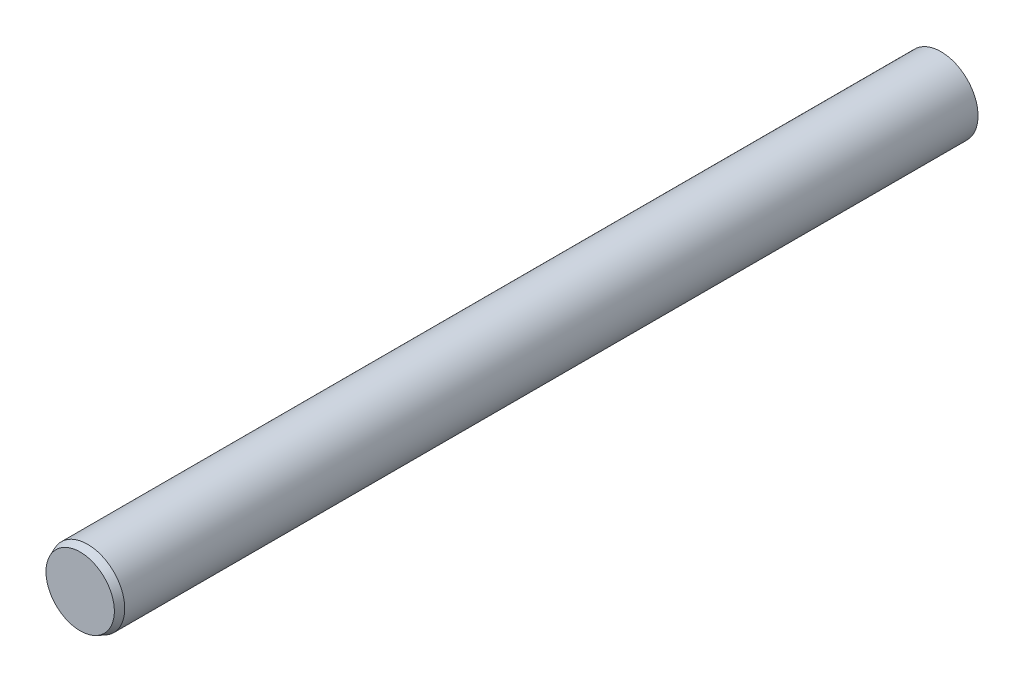
ISO-10303-21;
HEADER;
FILE_DESCRIPTION(('STEP AP214'),'2;1');
FILE_NAME('part.step','',(''),(''),'','','');
FILE_SCHEMA(('AUTOMOTIVE_DESIGN { 1 0 10303 214 1 1 1 1 }'));
ENDSEC;
DATA;
#1=APPLICATION_CONTEXT('core data for automotive mechanical design processes');
#2=APPLICATION_PROTOCOL_DEFINITION('international standard','automotive_design',2000,#1);
#3=PRODUCT_CONTEXT('',#1,'mechanical');
#4=PRODUCT('Part','Part','',(#3));
#5=PRODUCT_RELATED_PRODUCT_CATEGORY('part','',(#4));
#6=PRODUCT_DEFINITION_FORMATION('','',#4);
#7=PRODUCT_DEFINITION_CONTEXT('part definition',#1,'design');
#8=PRODUCT_DEFINITION('design','',#6,#7);
#9=PRODUCT_DEFINITION_SHAPE('','',#8);
#10=(LENGTH_UNIT() NAMED_UNIT(*) SI_UNIT(.MILLI.,.METRE.));
#11=(NAMED_UNIT(*) PLANE_ANGLE_UNIT() SI_UNIT($,.RADIAN.));
#12=(NAMED_UNIT(*) SI_UNIT($,.STERADIAN.) SOLID_ANGLE_UNIT());
#13=UNCERTAINTY_MEASURE_WITH_UNIT(LENGTH_MEASURE(1.E-05),#10,'distance_accuracy_value','');
#14=(GEOMETRIC_REPRESENTATION_CONTEXT(3) GLOBAL_UNCERTAINTY_ASSIGNED_CONTEXT((#13)) GLOBAL_UNIT_ASSIGNED_CONTEXT((#10,
#11,#12)) REPRESENTATION_CONTEXT('',''));
#15=CARTESIAN_POINT('',(0.,0.,0.));
#16=DIRECTION('',(0.,0.,1.));
#17=DIRECTION('',(1.,0.,0.));
#18=AXIS2_PLACEMENT_3D('',#15,#16,#17);
#19=CARTESIAN_POINT('',(0.,0.,19.766));
#20=DIRECTION('',(0.,0.,-1.));
#21=DIRECTION('',(-1.,0.,0.));
#22=AXIS2_PLACEMENT_3D('',#19,#20,#21);
#23=CONICAL_SURFACE('',#22,2.5,0.380506377112365);
#24=CARTESIAN_POINT('',(0.,0.,20.266));
#25=DIRECTION('',(0.,0.,-1.));
#26=DIRECTION('',(-1.,0.,0.));
#27=AXIS2_PLACEMENT_3D('',#24,#25,#26);
#28=CIRCLE('',#27,2.3);
#29=CARTESIAN_POINT('',(-2.3,0.,20.266));
#30=VERTEX_POINT('',#29);
#31=EDGE_CURVE('E10',#30,#30,#28,.T.);
#32=ORIENTED_EDGE('',*,*,#31,.T.);
#33=EDGE_LOOP('',(#32));
#34=FACE_BOUND('',#33,.T.);
#35=CARTESIAN_POINT('',(0.,0.,19.766));
#36=DIRECTION('',(0.,0.,-1.));
#37=DIRECTION('',(-1.,0.,0.));
#38=AXIS2_PLACEMENT_3D('',#35,#36,#37);
#39=CIRCLE('',#38,2.5);
#40=CARTESIAN_POINT('',(-2.5,0.,19.766));
#41=VERTEX_POINT('',#40);
#42=EDGE_CURVE('E53',#41,#41,#39,.T.);
#43=ORIENTED_EDGE('',*,*,#42,.F.);
#44=EDGE_LOOP('',(#43));
#45=FACE_BOUND('',#44,.T.);
#46=ADVANCED_FACE('F41',(#34,#45),#23,.T.);
#47=CARTESIAN_POINT('',(2.3,0.,20.266));
#48=DIRECTION('',(0.,0.,1.));
#49=DIRECTION('',(1.,0.,0.));
#50=AXIS2_PLACEMENT_3D('',#47,#48,#49);
#51=PLANE('',#50);
#52=ORIENTED_EDGE('',*,*,#31,.F.);
#53=EDGE_LOOP('',(#52));
#54=FACE_BOUND('',#53,.T.);
#55=ADVANCED_FACE('F65',(#54),#51,.T.);
#56=CARTESIAN_POINT('',(0.,0.,-37.654));
#57=DIRECTION('',(0.,0.,-1.));
#58=DIRECTION('',(-1.,0.,0.));
#59=AXIS2_PLACEMENT_3D('',#56,#57,#58);
#60=PLANE('',#59);
#61=CARTESIAN_POINT('',(0.,0.,-37.654));
#62=DIRECTION('',(0.,0.,-1.));
#63=DIRECTION('',(-1.,0.,0.));
#64=AXIS2_PLACEMENT_3D('',#61,#62,#63);
#65=CIRCLE('',#64,2.5);
#66=CARTESIAN_POINT('',(-2.5,0.,-37.654));
#67=VERTEX_POINT('',#66);
#68=EDGE_CURVE('E48',#67,#67,#65,.T.);
#69=ORIENTED_EDGE('',*,*,#68,.T.);
#70=EDGE_LOOP('',(#69));
#71=FACE_BOUND('',#70,.T.);
#72=ADVANCED_FACE('F69',(#71),#60,.T.);
#73=CARTESIAN_POINT('',(0.,0.,20.266));
#74=DIRECTION('',(0.,0.,-1.));
#75=DIRECTION('',(-1.,0.,0.));
#76=AXIS2_PLACEMENT_3D('',#73,#74,#75);
#77=CYLINDRICAL_SURFACE('',#76,2.5);
#78=ORIENTED_EDGE('',*,*,#42,.T.);
#79=EDGE_LOOP('',(#78));
#80=FACE_BOUND('',#79,.T.);
#81=ORIENTED_EDGE('',*,*,#68,.F.);
#82=EDGE_LOOP('',(#81));
#83=FACE_BOUND('',#82,.T.);
#84=ADVANCED_FACE('F61',(#80,#83),#77,.T.);
#85=CLOSED_SHELL('',(#46,#55,#72,#84));
#86=MANIFOLD_SOLID_BREP('B2',#85);
#87=ADVANCED_BREP_SHAPE_REPRESENTATION('',(#18,#86),#14);
#88=SHAPE_DEFINITION_REPRESENTATION(#9,#87);
ENDSEC;
END-ISO-10303-21;
